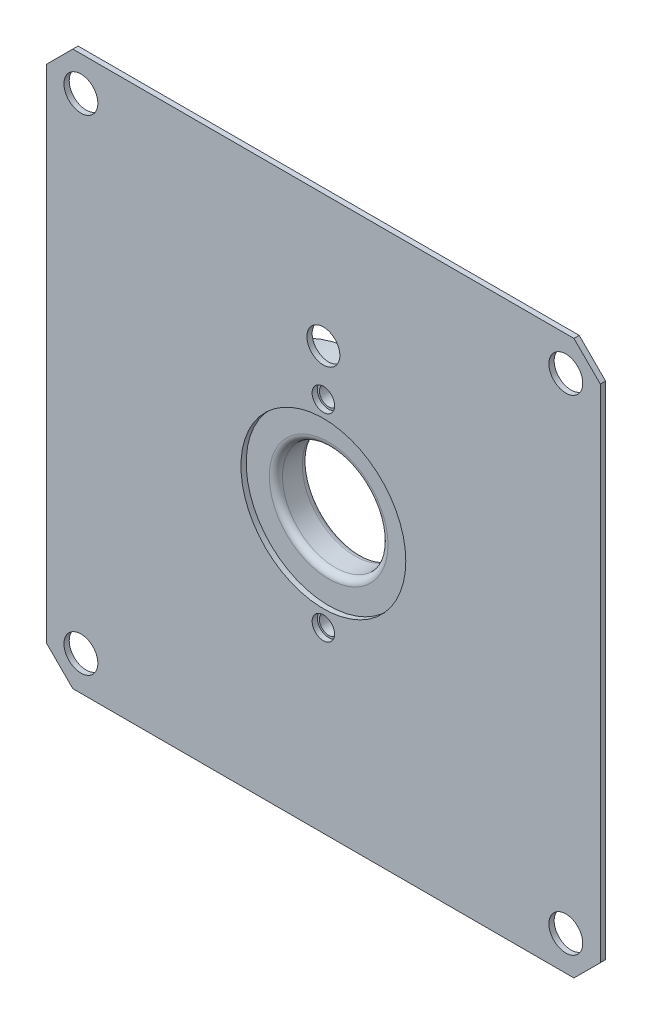
ISO-10303-21;
HEADER;
FILE_DESCRIPTION(('STEP AP214'),'2;1');
FILE_NAME('part.step','',(''),(''),'','','');
FILE_SCHEMA(('AUTOMOTIVE_DESIGN { 1 0 10303 214 1 1 1 1 }'));
ENDSEC;
DATA;
#1=APPLICATION_CONTEXT('core data for automotive mechanical design processes');
#2=APPLICATION_PROTOCOL_DEFINITION('international standard','automotive_design',2000,#1);
#3=PRODUCT_CONTEXT('',#1,'mechanical');
#4=PRODUCT('Part','Part','',(#3));
#5=PRODUCT_RELATED_PRODUCT_CATEGORY('part','',(#4));
#6=PRODUCT_DEFINITION_FORMATION('','',#4);
#7=PRODUCT_DEFINITION_CONTEXT('part definition',#1,'design');
#8=PRODUCT_DEFINITION('design','',#6,#7);
#9=PRODUCT_DEFINITION_SHAPE('','',#8);
#10=(LENGTH_UNIT() NAMED_UNIT(*) SI_UNIT(.MILLI.,.METRE.));
#11=(NAMED_UNIT(*) PLANE_ANGLE_UNIT() SI_UNIT($,.RADIAN.));
#12=(NAMED_UNIT(*) SI_UNIT($,.STERADIAN.) SOLID_ANGLE_UNIT());
#13=UNCERTAINTY_MEASURE_WITH_UNIT(LENGTH_MEASURE(1.E-05),#10,'distance_accuracy_value','');
#14=(GEOMETRIC_REPRESENTATION_CONTEXT(3) GLOBAL_UNCERTAINTY_ASSIGNED_CONTEXT((#13)) GLOBAL_UNIT_ASSIGNED_CONTEXT((#10,
#11,#12)) REPRESENTATION_CONTEXT('',''));
#15=CARTESIAN_POINT('',(0.,0.,0.));
#16=DIRECTION('',(0.,0.,1.));
#17=DIRECTION('',(1.,0.,0.));
#18=AXIS2_PLACEMENT_3D('',#15,#16,#17);
#19=CARTESIAN_POINT('',(0.,0.,3.175));
#20=DIRECTION('',(0.,0.,1.));
#21=DIRECTION('',(1.,0.,0.));
#22=AXIS2_PLACEMENT_3D('',#19,#20,#21);
#23=PLANE('',#22);
#24=CARTESIAN_POINT('',(0.,13.97,3.175));
#25=DIRECTION('',(0.,0.,1.));
#26=DIRECTION('',(1.,0.,0.));
#27=AXIS2_PLACEMENT_3D('',#24,#25,#26);
#28=CIRCLE('',#27,1.5875);
#29=CARTESIAN_POINT('',(1.5875,13.97,3.175));
#30=VERTEX_POINT('',#29);
#31=EDGE_CURVE('E249',#30,#30,#28,.T.);
#32=ORIENTED_EDGE('',*,*,#31,.T.);
#33=EDGE_LOOP('',(#32));
#34=FACE_BOUND('',#33,.T.);
#35=CARTESIAN_POINT('',(-23.3486659147798,23.3486659147798,3.175));
#36=DIRECTION('',(0.,0.,-1.));
#37=DIRECTION('',(-1.,0.,0.));
#38=AXIS2_PLACEMENT_3D('',#35,#36,#37);
#39=CIRCLE('',#38,1.63194999999999);
#40=CARTESIAN_POINT('',(-24.9806159147798,23.3486659147798,3.175));
#41=VERTEX_POINT('',#40);
#42=EDGE_CURVE('E240',#41,#41,#39,.T.);
#43=ORIENTED_EDGE('',*,*,#42,.F.);
#44=EDGE_LOOP('',(#43));
#45=FACE_BOUND('',#44,.T.);
#46=CARTESIAN_POINT('',(-23.3486659147798,-23.3486659147798,3.175));
#47=DIRECTION('',(0.,0.,-1.));
#48=DIRECTION('',(-1.,0.,0.));
#49=AXIS2_PLACEMENT_3D('',#46,#47,#48);
#50=CIRCLE('',#49,1.63194999999999);
#51=CARTESIAN_POINT('',(-24.9806159147798,-23.3486659147798,3.175));
#52=VERTEX_POINT('',#51);
#53=EDGE_CURVE('E234',#52,#52,#50,.T.);
#54=ORIENTED_EDGE('',*,*,#53,.F.);
#55=EDGE_LOOP('',(#54));
#56=FACE_BOUND('',#55,.T.);
#57=CARTESIAN_POINT('',(23.3486659147798,-23.3486659147798,3.175));
#58=DIRECTION('',(0.,0.,-1.));
#59=DIRECTION('',(-1.,0.,0.));
#60=AXIS2_PLACEMENT_3D('',#57,#58,#59);
#61=CIRCLE('',#60,1.63194999999999);
#62=CARTESIAN_POINT('',(21.7167159147798,-23.3486659147798,3.175));
#63=VERTEX_POINT('',#62);
#64=EDGE_CURVE('E228',#63,#63,#61,.T.);
#65=ORIENTED_EDGE('',*,*,#64,.F.);
#66=EDGE_LOOP('',(#65));
#67=FACE_BOUND('',#66,.T.);
#68=CARTESIAN_POINT('',(0.,0.,3.175));
#69=DIRECTION('',(0.,0.,1.));
#70=DIRECTION('',(1.,0.,0.));
#71=AXIS2_PLACEMENT_3D('',#68,#69,#70);
#72=CIRCLE('',#71,11.43);
#73=CARTESIAN_POINT('',(11.43,0.,3.175));
#74=VERTEX_POINT('',#73);
#75=EDGE_CURVE('E156',#74,#74,#72,.T.);
#76=ORIENTED_EDGE('',*,*,#75,.T.);
#77=EDGE_LOOP('',(#76));
#78=FACE_BOUND('',#77,.T.);
#79=DIRECTION('',(0.,-1.,0.));
#80=VECTOR('',#79,1.);
#81=CARTESIAN_POINT('',(-26.67,26.67,3.175));
#82=LINE('',#81,#80);
#83=CARTESIAN_POINT('',(-26.67,24.13,3.175));
#84=VERTEX_POINT('',#83);
#85=CARTESIAN_POINT('',(-26.67,-24.13,3.175));
#86=VERTEX_POINT('',#85);
#87=EDGE_CURVE('E118',#84,#86,#82,.T.);
#88=ORIENTED_EDGE('',*,*,#87,.F.);
#89=DIRECTION('',(-0.707106781186549,-0.707106781186546,0.));
#90=VECTOR('',#89,1.);
#91=CARTESIAN_POINT('',(-26.67,24.13,3.175));
#92=LINE('',#91,#90);
#93=CARTESIAN_POINT('',(-24.13,26.67,3.175));
#94=VERTEX_POINT('',#93);
#95=EDGE_CURVE('E101',#84,#94,#92,.F.);
#96=ORIENTED_EDGE('',*,*,#95,.T.);
#97=DIRECTION('',(-1.,0.,0.));
#98=VECTOR('',#97,1.);
#99=CARTESIAN_POINT('',(-26.67,26.67,3.175));
#100=LINE('',#99,#98);
#101=CARTESIAN_POINT('',(24.13,26.67,3.175));
#102=VERTEX_POINT('',#101);
#103=EDGE_CURVE('E141',#102,#94,#100,.T.);
#104=ORIENTED_EDGE('',*,*,#103,.F.);
#105=DIRECTION('',(-0.707106781186546,0.707106781186549,0.));
#106=VECTOR('',#105,1.);
#107=CARTESIAN_POINT('',(24.13,26.67,3.175));
#108=LINE('',#107,#106);
#109=CARTESIAN_POINT('',(26.67,24.13,3.175));
#110=VERTEX_POINT('',#109);
#111=EDGE_CURVE('E122',#102,#110,#108,.F.);
#112=ORIENTED_EDGE('',*,*,#111,.T.);
#113=DIRECTION('',(0.,1.,0.));
#114=VECTOR('',#113,1.);
#115=CARTESIAN_POINT('',(26.67,26.67,3.175));
#116=LINE('',#115,#114);
#117=CARTESIAN_POINT('',(26.67,-24.13,3.175));
#118=VERTEX_POINT('',#117);
#119=EDGE_CURVE('E131',#118,#110,#116,.T.);
#120=ORIENTED_EDGE('',*,*,#119,.F.);
#121=DIRECTION('',(0.707106781186549,0.707106781186546,0.));
#122=VECTOR('',#121,1.);
#123=CARTESIAN_POINT('',(26.67,-24.13,3.175));
#124=LINE('',#123,#122);
#125=CARTESIAN_POINT('',(24.13,-26.67,3.175));
#126=VERTEX_POINT('',#125);
#127=EDGE_CURVE('E184',#118,#126,#124,.F.);
#128=ORIENTED_EDGE('',*,*,#127,.T.);
#129=DIRECTION('',(1.,0.,0.));
#130=VECTOR('',#129,1.);
#131=CARTESIAN_POINT('',(-26.67,-26.67,3.175));
#132=LINE('',#131,#130);
#133=CARTESIAN_POINT('',(-24.13,-26.67,3.175));
#134=VERTEX_POINT('',#133);
#135=EDGE_CURVE('E127',#134,#126,#132,.T.);
#136=ORIENTED_EDGE('',*,*,#135,.F.);
#137=DIRECTION('',(0.707106781186546,-0.707106781186549,0.));
#138=VECTOR('',#137,1.);
#139=CARTESIAN_POINT('',(-24.13,-26.67,3.175));
#140=LINE('',#139,#138);
#141=EDGE_CURVE('E112',#134,#86,#140,.F.);
#142=ORIENTED_EDGE('',*,*,#141,.T.);
#143=EDGE_LOOP('',(#88,#96,#104,#112,#120,#128,#136,#142));
#144=FACE_BOUND('',#143,.T.);
#145=CARTESIAN_POINT('',(23.34866591478,23.3486659147796,3.175));
#146=DIRECTION('',(0.,0.,-1.));
#147=DIRECTION('',(-1.,0.,0.));
#148=AXIS2_PLACEMENT_3D('',#145,#146,#147);
#149=CIRCLE('',#148,1.63194999999999);
#150=CARTESIAN_POINT('',(21.71671591478,23.3486659147796,3.175));
#151=VERTEX_POINT('',#150);
#152=EDGE_CURVE('E246',#151,#151,#149,.T.);
#153=ORIENTED_EDGE('',*,*,#152,.F.);
#154=EDGE_LOOP('',(#153));
#155=FACE_BOUND('',#154,.T.);
#156=ADVANCED_FACE('F35',(#34,#45,#56,#67,#78,#144,#155),#23,.F.);
#157=CARTESIAN_POINT('',(0.,0.,3.683));
#158=DIRECTION('',(0.,0.,1.));
#159=DIRECTION('',(1.,0.,0.));
#160=AXIS2_PLACEMENT_3D('',#157,#158,#159);
#161=PLANE('',#160);
#162=CARTESIAN_POINT('',(0.,13.97,3.683));
#163=DIRECTION('',(0.,0.,1.));
#164=DIRECTION('',(1.,0.,0.));
#165=AXIS2_PLACEMENT_3D('',#162,#163,#164);
#166=CIRCLE('',#165,1.5875);
#167=CARTESIAN_POINT('',(1.5875,13.97,3.683));
#168=VERTEX_POINT('',#167);
#169=EDGE_CURVE('E250',#168,#168,#166,.T.);
#170=ORIENTED_EDGE('',*,*,#169,.F.);
#171=EDGE_LOOP('',(#170));
#172=FACE_BOUND('',#171,.T.);
#173=CARTESIAN_POINT('',(-23.3486659147798,23.3486659147798,3.683));
#174=DIRECTION('',(0.,0.,-1.));
#175=DIRECTION('',(-1.,0.,0.));
#176=AXIS2_PLACEMENT_3D('',#173,#174,#175);
#177=CIRCLE('',#176,1.63195);
#178=CARTESIAN_POINT('',(-24.9806159147798,23.3486659147798,3.683));
#179=VERTEX_POINT('',#178);
#180=EDGE_CURVE('E237',#179,#179,#177,.T.);
#181=ORIENTED_EDGE('',*,*,#180,.T.);
#182=EDGE_LOOP('',(#181));
#183=FACE_BOUND('',#182,.T.);
#184=CARTESIAN_POINT('',(-23.3486659147798,-23.3486659147798,3.683));
#185=DIRECTION('',(0.,0.,-1.));
#186=DIRECTION('',(-1.,0.,0.));
#187=AXIS2_PLACEMENT_3D('',#184,#185,#186);
#188=CIRCLE('',#187,1.63195);
#189=CARTESIAN_POINT('',(-24.9806159147798,-23.3486659147798,3.683));
#190=VERTEX_POINT('',#189);
#191=EDGE_CURVE('E231',#190,#190,#188,.T.);
#192=ORIENTED_EDGE('',*,*,#191,.T.);
#193=EDGE_LOOP('',(#192));
#194=FACE_BOUND('',#193,.T.);
#195=CARTESIAN_POINT('',(23.3486659147798,-23.3486659147798,3.683));
#196=DIRECTION('',(0.,0.,-1.));
#197=DIRECTION('',(-1.,0.,0.));
#198=AXIS2_PLACEMENT_3D('',#195,#196,#197);
#199=CIRCLE('',#198,1.63195);
#200=CARTESIAN_POINT('',(21.7167159147798,-23.3486659147798,3.683));
#201=VERTEX_POINT('',#200);
#202=EDGE_CURVE('E225',#201,#201,#199,.T.);
#203=ORIENTED_EDGE('',*,*,#202,.T.);
#204=EDGE_LOOP('',(#203));
#205=FACE_BOUND('',#204,.T.);
#206=CARTESIAN_POINT('',(0.,9.525,3.683));
#207=DIRECTION('',(0.,0.,1.));
#208=DIRECTION('',(1.,0.,0.));
#209=AXIS2_PLACEMENT_3D('',#206,#207,#208);
#210=CIRCLE('',#209,1.08481784837193);
#211=CARTESIAN_POINT('',(1.08481784837193,9.525,3.683));
#212=VERTEX_POINT('',#211);
#213=EDGE_CURVE('E134',#212,#212,#210,.T.);
#214=ORIENTED_EDGE('',*,*,#213,.F.);
#215=EDGE_LOOP('',(#214));
#216=FACE_BOUND('',#215,.T.);
#217=DIRECTION('',(-1.,0.,0.));
#218=VECTOR('',#217,1.);
#219=CARTESIAN_POINT('',(-26.67,26.67,3.683));
#220=LINE('',#219,#218);
#221=CARTESIAN_POINT('',(24.13,26.67,3.683));
#222=VERTEX_POINT('',#221);
#223=CARTESIAN_POINT('',(-24.13,26.67,3.683));
#224=VERTEX_POINT('',#223);
#225=EDGE_CURVE('E137',#222,#224,#220,.T.);
#226=ORIENTED_EDGE('',*,*,#225,.T.);
#227=DIRECTION('',(0.707106781186549,0.707106781186546,0.));
#228=VECTOR('',#227,1.);
#229=CARTESIAN_POINT('',(-25.3999999999999,25.4000000000001,3.683));
#230=LINE('',#229,#228);
#231=CARTESIAN_POINT('',(-26.67,24.13,3.683));
#232=VERTEX_POINT('',#231);
#233=EDGE_CURVE('E195',#224,#232,#230,.F.);
#234=ORIENTED_EDGE('',*,*,#233,.T.);
#235=DIRECTION('',(0.,-1.,0.));
#236=VECTOR('',#235,1.);
#237=CARTESIAN_POINT('',(-26.67,26.67,3.683));
#238=LINE('',#237,#236);
#239=CARTESIAN_POINT('',(-26.67,-24.13,3.683));
#240=VERTEX_POINT('',#239);
#241=EDGE_CURVE('E121',#232,#240,#238,.T.);
#242=ORIENTED_EDGE('',*,*,#241,.T.);
#243=DIRECTION('',(-0.707106781186546,0.707106781186549,0.));
#244=VECTOR('',#243,1.);
#245=CARTESIAN_POINT('',(-25.4000000000001,-25.3999999999999,3.683));
#246=LINE('',#245,#244);
#247=CARTESIAN_POINT('',(-24.13,-26.67,3.683));
#248=VERTEX_POINT('',#247);
#249=EDGE_CURVE('E193',#240,#248,#246,.F.);
#250=ORIENTED_EDGE('',*,*,#249,.T.);
#251=DIRECTION('',(1.,0.,0.));
#252=VECTOR('',#251,1.);
#253=CARTESIAN_POINT('',(-26.67,-26.67,3.683));
#254=LINE('',#253,#252);
#255=CARTESIAN_POINT('',(24.13,-26.67,3.683));
#256=VERTEX_POINT('',#255);
#257=EDGE_CURVE('E206',#248,#256,#254,.T.);
#258=ORIENTED_EDGE('',*,*,#257,.T.);
#259=DIRECTION('',(-0.707106781186549,-0.707106781186546,0.));
#260=VECTOR('',#259,1.);
#261=CARTESIAN_POINT('',(25.3999999999999,-25.4000000000001,3.683));
#262=LINE('',#261,#260);
#263=CARTESIAN_POINT('',(26.67,-24.13,3.683));
#264=VERTEX_POINT('',#263);
#265=EDGE_CURVE('E56',#256,#264,#262,.F.);
#266=ORIENTED_EDGE('',*,*,#265,.T.);
#267=DIRECTION('',(0.,1.,0.));
#268=VECTOR('',#267,1.);
#269=CARTESIAN_POINT('',(26.67,26.67,3.683));
#270=LINE('',#269,#268);
#271=CARTESIAN_POINT('',(26.67,24.13,3.683));
#272=VERTEX_POINT('',#271);
#273=EDGE_CURVE('E214',#264,#272,#270,.T.);
#274=ORIENTED_EDGE('',*,*,#273,.T.);
#275=DIRECTION('',(0.707106781186546,-0.707106781186549,0.));
#276=VECTOR('',#275,1.);
#277=CARTESIAN_POINT('',(25.4000000000001,25.3999999999999,3.683));
#278=LINE('',#277,#276);
#279=EDGE_CURVE('E190',#272,#222,#278,.F.);
#280=ORIENTED_EDGE('',*,*,#279,.T.);
#281=EDGE_LOOP('',(#226,#234,#242,#250,#258,#266,#274,#280));
#282=FACE_BOUND('',#281,.T.);
#283=CARTESIAN_POINT('',(0.,0.,3.683));
#284=DIRECTION('',(0.,0.,1.));
#285=DIRECTION('',(1.,0.,0.));
#286=AXIS2_PLACEMENT_3D('',#283,#284,#285);
#287=CIRCLE('',#286,7.9375);
#288=CARTESIAN_POINT('',(7.9375,0.,3.683));
#289=VERTEX_POINT('',#288);
#290=EDGE_CURVE('E128',#289,#289,#287,.T.);
#291=ORIENTED_EDGE('',*,*,#290,.F.);
#292=EDGE_LOOP('',(#291));
#293=FACE_BOUND('',#292,.T.);
#294=CARTESIAN_POINT('',(0.,-9.525,3.683));
#295=DIRECTION('',(0.,0.,1.));
#296=DIRECTION('',(1.,0.,0.));
#297=AXIS2_PLACEMENT_3D('',#294,#295,#296);
#298=CIRCLE('',#297,1.08040080950184);
#299=CARTESIAN_POINT('',(1.08040080950184,-9.525,3.683));
#300=VERTEX_POINT('',#299);
#301=EDGE_CURVE('E222',#300,#300,#298,.T.);
#302=ORIENTED_EDGE('',*,*,#301,.F.);
#303=EDGE_LOOP('',(#302));
#304=FACE_BOUND('',#303,.T.);
#305=CARTESIAN_POINT('',(23.34866591478,23.3486659147796,3.683));
#306=DIRECTION('',(0.,0.,-1.));
#307=DIRECTION('',(-1.,0.,0.));
#308=AXIS2_PLACEMENT_3D('',#305,#306,#307);
#309=CIRCLE('',#308,1.63195);
#310=CARTESIAN_POINT('',(21.71671591478,23.3486659147796,3.683));
#311=VERTEX_POINT('',#310);
#312=EDGE_CURVE('E243',#311,#311,#309,.T.);
#313=ORIENTED_EDGE('',*,*,#312,.T.);
#314=EDGE_LOOP('',(#313));
#315=FACE_BOUND('',#314,.T.);
#316=ADVANCED_FACE('F265',(#172,#183,#194,#205,#216,#282,#293,#304,#315),#161,.T.);
#317=CARTESIAN_POINT('',(0.,0.,3.175));
#318=DIRECTION('',(0.,0.,1.));
#319=DIRECTION('',(1.,0.,0.));
#320=AXIS2_PLACEMENT_3D('',#317,#318,#319);
#321=PLANE('',#320);
#322=CARTESIAN_POINT('',(0.,0.,3.175));
#323=DIRECTION('',(0.,0.,1.));
#324=DIRECTION('',(1.,0.,0.));
#325=AXIS2_PLACEMENT_3D('',#322,#323,#324);
#326=CIRCLE('',#325,5.715);
#327=CARTESIAN_POINT('',(5.715,0.,3.175));
#328=VERTEX_POINT('',#327);
#329=EDGE_CURVE('E170',#328,#328,#326,.F.);
#330=ORIENTED_EDGE('',*,*,#329,.T.);
#331=EDGE_LOOP('',(#330));
#332=FACE_BOUND('',#331,.T.);
#333=CARTESIAN_POINT('',(0.,0.,3.175));
#334=DIRECTION('',(0.,0.,1.));
#335=DIRECTION('',(1.,0.,0.));
#336=AXIS2_PLACEMENT_3D('',#333,#334,#335);
#337=CIRCLE('',#336,7.9375);
#338=CARTESIAN_POINT('',(7.9375,0.,3.175));
#339=VERTEX_POINT('',#338);
#340=EDGE_CURVE('E179',#339,#339,#337,.F.);
#341=ORIENTED_EDGE('',*,*,#340,.F.);
#342=EDGE_LOOP('',(#341));
#343=FACE_BOUND('',#342,.T.);
#344=ADVANCED_FACE('F268',(#332,#343),#321,.T.);
#345=CARTESIAN_POINT('',(0.,9.525,3.175));
#346=DIRECTION('',(0.,0.,1.));
#347=DIRECTION('',(1.,0.,0.));
#348=AXIS2_PLACEMENT_3D('',#345,#346,#347);
#349=CIRCLE('',#348,0.889);
#350=CARTESIAN_POINT('',(0.889,9.525,3.175));
#351=VERTEX_POINT('',#350);
#352=EDGE_CURVE('E149',#351,#351,#349,.T.);
#353=ORIENTED_EDGE('',*,*,#352,.F.);
#354=EDGE_LOOP('',(#353));
#355=FACE_BOUND('',#354,.T.);
#356=CARTESIAN_POINT('',(0.,9.525,3.175));
#357=DIRECTION('',(0.,0.,1.));
#358=DIRECTION('',(1.,0.,0.));
#359=AXIS2_PLACEMENT_3D('',#356,#357,#358);
#360=CIRCLE('',#359,1.08481784837193);
#361=CARTESIAN_POINT('',(1.08481784837193,9.525,3.175));
#362=VERTEX_POINT('',#361);
#363=EDGE_CURVE('E176',#362,#362,#360,.F.);
#364=ORIENTED_EDGE('',*,*,#363,.F.);
#365=EDGE_LOOP('',(#364));
#366=FACE_BOUND('',#365,.T.);
#367=ADVANCED_FACE('F324',(#355,#366),#321,.T.);
#368=CARTESIAN_POINT('',(0.,-9.525,3.175));
#369=DIRECTION('',(0.,0.,1.));
#370=DIRECTION('',(1.,0.,0.));
#371=AXIS2_PLACEMENT_3D('',#368,#369,#370);
#372=CIRCLE('',#371,0.889);
#373=CARTESIAN_POINT('',(0.889,-9.525,3.175));
#374=VERTEX_POINT('',#373);
#375=EDGE_CURVE('E143',#374,#374,#372,.T.);
#376=ORIENTED_EDGE('',*,*,#375,.F.);
#377=EDGE_LOOP('',(#376));
#378=FACE_BOUND('',#377,.T.);
#379=CARTESIAN_POINT('',(0.,-9.525,3.175));
#380=DIRECTION('',(0.,0.,1.));
#381=DIRECTION('',(1.,0.,0.));
#382=AXIS2_PLACEMENT_3D('',#379,#380,#381);
#383=CIRCLE('',#382,1.08040080950184);
#384=CARTESIAN_POINT('',(1.08040080950184,-9.525,3.175));
#385=VERTEX_POINT('',#384);
#386=EDGE_CURVE('E173',#385,#385,#383,.F.);
#387=ORIENTED_EDGE('',*,*,#386,.F.);
#388=EDGE_LOOP('',(#387));
#389=FACE_BOUND('',#388,.T.);
#390=ADVANCED_FACE('F326',(#378,#389),#321,.T.);
#391=CARTESIAN_POINT('',(0.,0.,0.));
#392=DIRECTION('',(0.,0.,1.));
#393=DIRECTION('',(1.,0.,0.));
#394=AXIS2_PLACEMENT_3D('',#391,#392,#393);
#395=PLANE('',#394);
#396=CARTESIAN_POINT('',(0.,-9.525,0.));
#397=DIRECTION('',(0.,0.,1.));
#398=DIRECTION('',(1.,0.,0.));
#399=AXIS2_PLACEMENT_3D('',#396,#397,#398);
#400=CIRCLE('',#399,0.888999999999999);
#401=CARTESIAN_POINT('',(0.888999999999999,-9.525,0.));
#402=VERTEX_POINT('',#401);
#403=EDGE_CURVE('E146',#402,#402,#400,.T.);
#404=ORIENTED_EDGE('',*,*,#403,.T.);
#405=EDGE_LOOP('',(#404));
#406=FACE_BOUND('',#405,.T.);
#407=CARTESIAN_POINT('',(0.,9.525,0.));
#408=DIRECTION('',(0.,0.,1.));
#409=DIRECTION('',(1.,0.,0.));
#410=AXIS2_PLACEMENT_3D('',#407,#408,#409);
#411=CIRCLE('',#410,0.888999999999999);
#412=CARTESIAN_POINT('',(0.888999999999999,9.525,0.));
#413=VERTEX_POINT('',#412);
#414=EDGE_CURVE('E152',#413,#413,#411,.T.);
#415=ORIENTED_EDGE('',*,*,#414,.T.);
#416=EDGE_LOOP('',(#415));
#417=FACE_BOUND('',#416,.T.);
#418=CARTESIAN_POINT('',(0.,0.,0.));
#419=DIRECTION('',(0.,0.,1.));
#420=DIRECTION('',(1.,0.,0.));
#421=AXIS2_PLACEMENT_3D('',#418,#419,#420);
#422=CIRCLE('',#421,5.715);
#423=CARTESIAN_POINT('',(5.715,0.,0.));
#424=VERTEX_POINT('',#423);
#425=EDGE_CURVE('E159',#424,#424,#422,.T.);
#426=ORIENTED_EDGE('',*,*,#425,.T.);
#427=EDGE_LOOP('',(#426));
#428=FACE_BOUND('',#427,.T.);
#429=CARTESIAN_POINT('',(0.,0.,0.));
#430=DIRECTION('',(0.,0.,1.));
#431=DIRECTION('',(1.,0.,0.));
#432=AXIS2_PLACEMENT_3D('',#429,#430,#431);
#433=CIRCLE('',#432,11.43);
#434=CARTESIAN_POINT('',(11.43,0.,0.));
#435=VERTEX_POINT('',#434);
#436=EDGE_CURVE('E155',#435,#435,#433,.T.);
#437=ORIENTED_EDGE('',*,*,#436,.F.);
#438=EDGE_LOOP('',(#437));
#439=FACE_BOUND('',#438,.T.);
#440=ADVANCED_FACE('F327',(#406,#417,#428,#439),#395,.F.);
#441=CARTESIAN_POINT('',(0.,0.,3.175));
#442=DIRECTION('',(0.,0.,-1.));
#443=DIRECTION('',(-1.,0.,0.));
#444=AXIS2_PLACEMENT_3D('',#441,#442,#443);
#445=CYLINDRICAL_SURFACE('',#444,11.43);
#446=ORIENTED_EDGE('',*,*,#75,.F.);
#447=EDGE_LOOP('',(#446));
#448=FACE_BOUND('',#447,.T.);
#449=ORIENTED_EDGE('',*,*,#436,.T.);
#450=EDGE_LOOP('',(#449));
#451=FACE_BOUND('',#450,.T.);
#452=ADVANCED_FACE('F320',(#448,#451),#445,.T.);
#453=CARTESIAN_POINT('',(0.,0.,3.175));
#454=DIRECTION('',(0.,0.,-1.));
#455=DIRECTION('',(-1.,0.,0.));
#456=AXIS2_PLACEMENT_3D('',#453,#454,#455);
#457=CYLINDRICAL_SURFACE('',#456,5.08);
#458=CARTESIAN_POINT('',(0.,0.,0.635));
#459=DIRECTION('',(0.,0.,1.));
#460=DIRECTION('',(1.,0.,0.));
#461=AXIS2_PLACEMENT_3D('',#458,#459,#460);
#462=CIRCLE('',#461,5.08);
#463=CARTESIAN_POINT('',(5.08,0.,0.635));
#464=VERTEX_POINT('',#463);
#465=EDGE_CURVE('E167',#464,#464,#462,.F.);
#466=ORIENTED_EDGE('',*,*,#465,.T.);
#467=EDGE_LOOP('',(#466));
#468=FACE_BOUND('',#467,.T.);
#469=CARTESIAN_POINT('',(0.,0.,2.54));
#470=DIRECTION('',(0.,0.,1.));
#471=DIRECTION('',(1.,0.,0.));
#472=AXIS2_PLACEMENT_3D('',#469,#470,#471);
#473=CIRCLE('',#472,5.08);
#474=CARTESIAN_POINT('',(5.08,0.,2.54));
#475=VERTEX_POINT('',#474);
#476=EDGE_CURVE('E164',#475,#475,#473,.T.);
#477=ORIENTED_EDGE('',*,*,#476,.T.);
#478=EDGE_LOOP('',(#477));
#479=FACE_BOUND('',#478,.T.);
#480=ADVANCED_FACE('F316',(#468,#479),#457,.F.);
#481=CARTESIAN_POINT('',(0.,0.,0.635));
#482=DIRECTION('',(0.,0.,1.));
#483=DIRECTION('',(1.,0.,0.));
#484=AXIS2_PLACEMENT_3D('',#481,#482,#483);
#485=TOROIDAL_SURFACE('',#484,5.715,0.635);
#486=ORIENTED_EDGE('',*,*,#465,.F.);
#487=EDGE_LOOP('',(#486));
#488=FACE_BOUND('',#487,.T.);
#489=ORIENTED_EDGE('',*,*,#425,.F.);
#490=EDGE_LOOP('',(#489));
#491=FACE_BOUND('',#490,.T.);
#492=ADVANCED_FACE('F319',(#488,#491),#485,.T.);
#493=CARTESIAN_POINT('',(0.,0.,2.54));
#494=DIRECTION('',(0.,0.,1.));
#495=DIRECTION('',(1.,0.,0.));
#496=AXIS2_PLACEMENT_3D('',#493,#494,#495);
#497=TOROIDAL_SURFACE('',#496,5.715,0.635);
#498=ORIENTED_EDGE('',*,*,#329,.F.);
#499=EDGE_LOOP('',(#498));
#500=FACE_BOUND('',#499,.T.);
#501=ORIENTED_EDGE('',*,*,#476,.F.);
#502=EDGE_LOOP('',(#501));
#503=FACE_BOUND('',#502,.T.);
#504=ADVANCED_FACE('F314',(#500,#503),#497,.T.);
#505=CARTESIAN_POINT('',(0.,9.525,3.175));
#506=DIRECTION('',(0.,0.,1.));
#507=DIRECTION('',(1.,0.,0.));
#508=AXIS2_PLACEMENT_3D('',#505,#506,#507);
#509=CYLINDRICAL_SURFACE('',#508,0.888999999999999);
#510=ORIENTED_EDGE('',*,*,#414,.F.);
#511=EDGE_LOOP('',(#510));
#512=FACE_BOUND('',#511,.T.);
#513=ORIENTED_EDGE('',*,*,#352,.T.);
#514=EDGE_LOOP('',(#513));
#515=FACE_BOUND('',#514,.T.);
#516=ADVANCED_FACE('F310',(#512,#515),#509,.F.);
#517=CARTESIAN_POINT('',(0.,-9.525,3.175));
#518=DIRECTION('',(0.,0.,1.));
#519=DIRECTION('',(1.,0.,0.));
#520=AXIS2_PLACEMENT_3D('',#517,#518,#519);
#521=CYLINDRICAL_SURFACE('',#520,0.888999999999999);
#522=ORIENTED_EDGE('',*,*,#403,.F.);
#523=EDGE_LOOP('',(#522));
#524=FACE_BOUND('',#523,.T.);
#525=ORIENTED_EDGE('',*,*,#375,.T.);
#526=EDGE_LOOP('',(#525));
#527=FACE_BOUND('',#526,.T.);
#528=ADVANCED_FACE('F307',(#524,#527),#521,.F.);
#529=CARTESIAN_POINT('',(-26.67,26.67,3.683));
#530=DIRECTION('',(1.,0.,0.));
#531=DIRECTION('',(0.,1.,0.));
#532=AXIS2_PLACEMENT_3D('',#529,#530,#531);
#533=PLANE('',#532);
#534=ORIENTED_EDGE('',*,*,#241,.F.);
#535=DIRECTION('',(0.,0.,-1.));
#536=VECTOR('',#535,1.);
#537=CARTESIAN_POINT('',(-26.67,24.13,3.683));
#538=LINE('',#537,#536);
#539=EDGE_CURVE('E105',#232,#84,#538,.T.);
#540=ORIENTED_EDGE('',*,*,#539,.T.);
#541=ORIENTED_EDGE('',*,*,#87,.T.);
#542=DIRECTION('',(0.,0.,1.));
#543=VECTOR('',#542,1.);
#544=CARTESIAN_POINT('',(-26.67,-24.13,3.683));
#545=LINE('',#544,#543);
#546=EDGE_CURVE('E123',#86,#240,#545,.T.);
#547=ORIENTED_EDGE('',*,*,#546,.T.);
#548=EDGE_LOOP('',(#534,#540,#541,#547));
#549=FACE_BOUND('',#548,.T.);
#550=ADVANCED_FACE('F117',(#549),#533,.F.);
#551=CARTESIAN_POINT('',(-26.67,-26.67,3.683));
#552=DIRECTION('',(0.,1.,0.));
#553=DIRECTION('',(0.,0.,1.));
#554=AXIS2_PLACEMENT_3D('',#551,#552,#553);
#555=PLANE('',#554);
#556=ORIENTED_EDGE('',*,*,#257,.F.);
#557=DIRECTION('',(0.,0.,-1.));
#558=VECTOR('',#557,1.);
#559=CARTESIAN_POINT('',(-24.13,-26.67,3.683));
#560=LINE('',#559,#558);
#561=EDGE_CURVE('E199',#248,#134,#560,.T.);
#562=ORIENTED_EDGE('',*,*,#561,.T.);
#563=ORIENTED_EDGE('',*,*,#135,.T.);
#564=DIRECTION('',(0.,0.,1.));
#565=VECTOR('',#564,1.);
#566=CARTESIAN_POINT('',(24.13,-26.67,3.683));
#567=LINE('',#566,#565);
#568=EDGE_CURVE('E197',#126,#256,#567,.T.);
#569=ORIENTED_EDGE('',*,*,#568,.T.);
#570=EDGE_LOOP('',(#556,#562,#563,#569));
#571=FACE_BOUND('',#570,.T.);
#572=ADVANCED_FACE('F204',(#571),#555,.F.);
#573=CARTESIAN_POINT('',(26.67,26.67,3.683));
#574=DIRECTION('',(-1.,0.,0.));
#575=DIRECTION('',(0.,-1.,0.));
#576=AXIS2_PLACEMENT_3D('',#573,#574,#575);
#577=PLANE('',#576);
#578=ORIENTED_EDGE('',*,*,#273,.F.);
#579=DIRECTION('',(0.,0.,-1.));
#580=VECTOR('',#579,1.);
#581=CARTESIAN_POINT('',(26.67,-24.13,3.683));
#582=LINE('',#581,#580);
#583=EDGE_CURVE('E11',#264,#118,#582,.T.);
#584=ORIENTED_EDGE('',*,*,#583,.T.);
#585=ORIENTED_EDGE('',*,*,#119,.T.);
#586=DIRECTION('',(0.,0.,1.));
#587=VECTOR('',#586,1.);
#588=CARTESIAN_POINT('',(26.67,24.13,3.683));
#589=LINE('',#588,#587);
#590=EDGE_CURVE('E43',#110,#272,#589,.T.);
#591=ORIENTED_EDGE('',*,*,#590,.T.);
#592=EDGE_LOOP('',(#578,#584,#585,#591));
#593=FACE_BOUND('',#592,.T.);
#594=ADVANCED_FACE('F213',(#593),#577,.F.);
#595=CARTESIAN_POINT('',(-26.67,26.67,3.683));
#596=DIRECTION('',(0.,-1.,0.));
#597=DIRECTION('',(0.,0.,-1.));
#598=AXIS2_PLACEMENT_3D('',#595,#596,#597);
#599=PLANE('',#598);
#600=ORIENTED_EDGE('',*,*,#103,.T.);
#601=DIRECTION('',(0.,0.,1.));
#602=VECTOR('',#601,1.);
#603=CARTESIAN_POINT('',(-24.13,26.67,3.683));
#604=LINE('',#603,#602);
#605=EDGE_CURVE('E106',#94,#224,#604,.T.);
#606=ORIENTED_EDGE('',*,*,#605,.T.);
#607=ORIENTED_EDGE('',*,*,#225,.F.);
#608=DIRECTION('',(0.,0.,-1.));
#609=VECTOR('',#608,1.);
#610=CARTESIAN_POINT('',(24.13,26.67,3.683));
#611=LINE('',#610,#609);
#612=EDGE_CURVE('E111',#222,#102,#611,.T.);
#613=ORIENTED_EDGE('',*,*,#612,.T.);
#614=EDGE_LOOP('',(#600,#606,#607,#613));
#615=FACE_BOUND('',#614,.T.);
#616=ADVANCED_FACE('F296',(#615),#599,.F.);
#617=CARTESIAN_POINT('',(0.,0.,3.683));
#618=DIRECTION('',(0.,0.,-1.));
#619=DIRECTION('',(-1.,0.,0.));
#620=AXIS2_PLACEMENT_3D('',#617,#618,#619);
#621=CYLINDRICAL_SURFACE('',#620,7.9375);
#622=ORIENTED_EDGE('',*,*,#290,.T.);
#623=EDGE_LOOP('',(#622));
#624=FACE_BOUND('',#623,.T.);
#625=ORIENTED_EDGE('',*,*,#340,.T.);
#626=EDGE_LOOP('',(#625));
#627=FACE_BOUND('',#626,.T.);
#628=ADVANCED_FACE('F299',(#624,#627),#621,.F.);
#629=CARTESIAN_POINT('',(0.,9.525,3.683));
#630=DIRECTION('',(0.,0.,-1.));
#631=DIRECTION('',(-1.,0.,0.));
#632=AXIS2_PLACEMENT_3D('',#629,#630,#631);
#633=CYLINDRICAL_SURFACE('',#632,1.08481784837193);
#634=ORIENTED_EDGE('',*,*,#213,.T.);
#635=EDGE_LOOP('',(#634));
#636=FACE_BOUND('',#635,.T.);
#637=ORIENTED_EDGE('',*,*,#363,.T.);
#638=EDGE_LOOP('',(#637));
#639=FACE_BOUND('',#638,.T.);
#640=ADVANCED_FACE('F456',(#636,#639),#633,.F.);
#641=CARTESIAN_POINT('',(0.,-9.525,3.683));
#642=DIRECTION('',(0.,0.,-1.));
#643=DIRECTION('',(-1.,0.,0.));
#644=AXIS2_PLACEMENT_3D('',#641,#642,#643);
#645=CYLINDRICAL_SURFACE('',#644,1.08040080950184);
#646=ORIENTED_EDGE('',*,*,#301,.T.);
#647=EDGE_LOOP('',(#646));
#648=FACE_BOUND('',#647,.T.);
#649=ORIENTED_EDGE('',*,*,#386,.T.);
#650=EDGE_LOOP('',(#649));
#651=FACE_BOUND('',#650,.T.);
#652=ADVANCED_FACE('F446',(#648,#651),#645,.F.);
#653=CARTESIAN_POINT('',(23.3486659147798,-23.3486659147798,3.175));
#654=DIRECTION('',(0.,0.,-1.));
#655=DIRECTION('',(-1.,0.,0.));
#656=AXIS2_PLACEMENT_3D('',#653,#654,#655);
#657=CYLINDRICAL_SURFACE('',#656,1.63194999999999);
#658=ORIENTED_EDGE('',*,*,#202,.F.);
#659=EDGE_LOOP('',(#658));
#660=FACE_BOUND('',#659,.T.);
#661=ORIENTED_EDGE('',*,*,#64,.T.);
#662=EDGE_LOOP('',(#661));
#663=FACE_BOUND('',#662,.T.);
#664=ADVANCED_FACE('F437',(#660,#663),#657,.F.);
#665=CARTESIAN_POINT('',(-23.3486659147798,-23.3486659147798,3.175));
#666=DIRECTION('',(0.,0.,-1.));
#667=DIRECTION('',(-1.,0.,0.));
#668=AXIS2_PLACEMENT_3D('',#665,#666,#667);
#669=CYLINDRICAL_SURFACE('',#668,1.63194999999999);
#670=ORIENTED_EDGE('',*,*,#191,.F.);
#671=EDGE_LOOP('',(#670));
#672=FACE_BOUND('',#671,.T.);
#673=ORIENTED_EDGE('',*,*,#53,.T.);
#674=EDGE_LOOP('',(#673));
#675=FACE_BOUND('',#674,.T.);
#676=ADVANCED_FACE('F428',(#672,#675),#669,.F.);
#677=CARTESIAN_POINT('',(-23.3486659147798,23.3486659147798,3.175));
#678=DIRECTION('',(0.,0.,-1.));
#679=DIRECTION('',(-1.,0.,0.));
#680=AXIS2_PLACEMENT_3D('',#677,#678,#679);
#681=CYLINDRICAL_SURFACE('',#680,1.63194999999999);
#682=ORIENTED_EDGE('',*,*,#180,.F.);
#683=EDGE_LOOP('',(#682));
#684=FACE_BOUND('',#683,.T.);
#685=ORIENTED_EDGE('',*,*,#42,.T.);
#686=EDGE_LOOP('',(#685));
#687=FACE_BOUND('',#686,.T.);
#688=ADVANCED_FACE('F287',(#684,#687),#681,.F.);
#689=CARTESIAN_POINT('',(23.34866591478,23.3486659147796,3.175));
#690=DIRECTION('',(0.,0.,-1.));
#691=DIRECTION('',(-1.,0.,0.));
#692=AXIS2_PLACEMENT_3D('',#689,#690,#691);
#693=CYLINDRICAL_SURFACE('',#692,1.63194999999999);
#694=ORIENTED_EDGE('',*,*,#312,.F.);
#695=EDGE_LOOP('',(#694));
#696=FACE_BOUND('',#695,.T.);
#697=ORIENTED_EDGE('',*,*,#152,.T.);
#698=EDGE_LOOP('',(#697));
#699=FACE_BOUND('',#698,.T.);
#700=ADVANCED_FACE('F261',(#696,#699),#693,.F.);
#701=CARTESIAN_POINT('',(0.,13.97,3.175));
#702=DIRECTION('',(0.,0.,1.));
#703=DIRECTION('',(1.,0.,0.));
#704=AXIS2_PLACEMENT_3D('',#701,#702,#703);
#705=CYLINDRICAL_SURFACE('',#704,1.5875);
#706=ORIENTED_EDGE('',*,*,#31,.F.);
#707=EDGE_LOOP('',(#706));
#708=FACE_BOUND('',#707,.T.);
#709=ORIENTED_EDGE('',*,*,#169,.T.);
#710=EDGE_LOOP('',(#709));
#711=FACE_BOUND('',#710,.T.);
#712=ADVANCED_FACE('F258',(#708,#711),#705,.F.);
#713=CARTESIAN_POINT('',(-26.67,24.13,3.683));
#714=DIRECTION('',(0.707106781186545,-0.707106781186549,0.));
#715=DIRECTION('',(0.,0.,-1.));
#716=AXIS2_PLACEMENT_3D('',#713,#714,#715);
#717=PLANE('',#716);
#718=ORIENTED_EDGE('',*,*,#233,.F.);
#719=ORIENTED_EDGE('',*,*,#605,.F.);
#720=ORIENTED_EDGE('',*,*,#95,.F.);
#721=ORIENTED_EDGE('',*,*,#539,.F.);
#722=EDGE_LOOP('',(#718,#719,#720,#721));
#723=FACE_BOUND('',#722,.T.);
#724=ADVANCED_FACE('F104',(#723),#717,.F.);
#725=CARTESIAN_POINT('',(-24.13,-26.67,3.683));
#726=DIRECTION('',(0.707106781186549,0.707106781186546,0.));
#727=DIRECTION('',(0.,0.,-1.));
#728=AXIS2_PLACEMENT_3D('',#725,#726,#727);
#729=PLANE('',#728);
#730=ORIENTED_EDGE('',*,*,#249,.F.);
#731=ORIENTED_EDGE('',*,*,#546,.F.);
#732=ORIENTED_EDGE('',*,*,#141,.F.);
#733=ORIENTED_EDGE('',*,*,#561,.F.);
#734=EDGE_LOOP('',(#730,#731,#732,#733));
#735=FACE_BOUND('',#734,.T.);
#736=ADVANCED_FACE('F342',(#735),#729,.F.);
#737=CARTESIAN_POINT('',(26.67,-24.13,3.683));
#738=DIRECTION('',(-0.707106781186546,0.707106781186549,0.));
#739=DIRECTION('',(0.,0.,-1.));
#740=AXIS2_PLACEMENT_3D('',#737,#738,#739);
#741=PLANE('',#740);
#742=ORIENTED_EDGE('',*,*,#265,.F.);
#743=ORIENTED_EDGE('',*,*,#568,.F.);
#744=ORIENTED_EDGE('',*,*,#127,.F.);
#745=ORIENTED_EDGE('',*,*,#583,.F.);
#746=EDGE_LOOP('',(#742,#743,#744,#745));
#747=FACE_BOUND('',#746,.T.);
#748=ADVANCED_FACE('F212',(#747),#741,.F.);
#749=CARTESIAN_POINT('',(24.13,26.67,3.683));
#750=DIRECTION('',(-0.707106781186549,-0.707106781186546,0.));
#751=DIRECTION('',(0.,0.,-1.));
#752=AXIS2_PLACEMENT_3D('',#749,#750,#751);
#753=PLANE('',#752);
#754=ORIENTED_EDGE('',*,*,#279,.F.);
#755=ORIENTED_EDGE('',*,*,#590,.F.);
#756=ORIENTED_EDGE('',*,*,#111,.F.);
#757=ORIENTED_EDGE('',*,*,#612,.F.);
#758=EDGE_LOOP('',(#754,#755,#756,#757));
#759=FACE_BOUND('',#758,.T.);
#760=ADVANCED_FACE('F37',(#759),#753,.F.);
#761=CLOSED_SHELL('',(#156,#316,#344,#367,#390,#440,#452,#480,#492,#504,#516,#528,#550,#572,
#594,#616,#628,#640,#652,#664,#676,#688,#700,#712,#724,#736,#748,#760));
#762=MANIFOLD_SOLID_BREP('B2',#761);
#763=ADVANCED_BREP_SHAPE_REPRESENTATION('',(#18,#762),#14);
#764=SHAPE_DEFINITION_REPRESENTATION(#9,#763);
ENDSEC;
END-ISO-10303-21;
